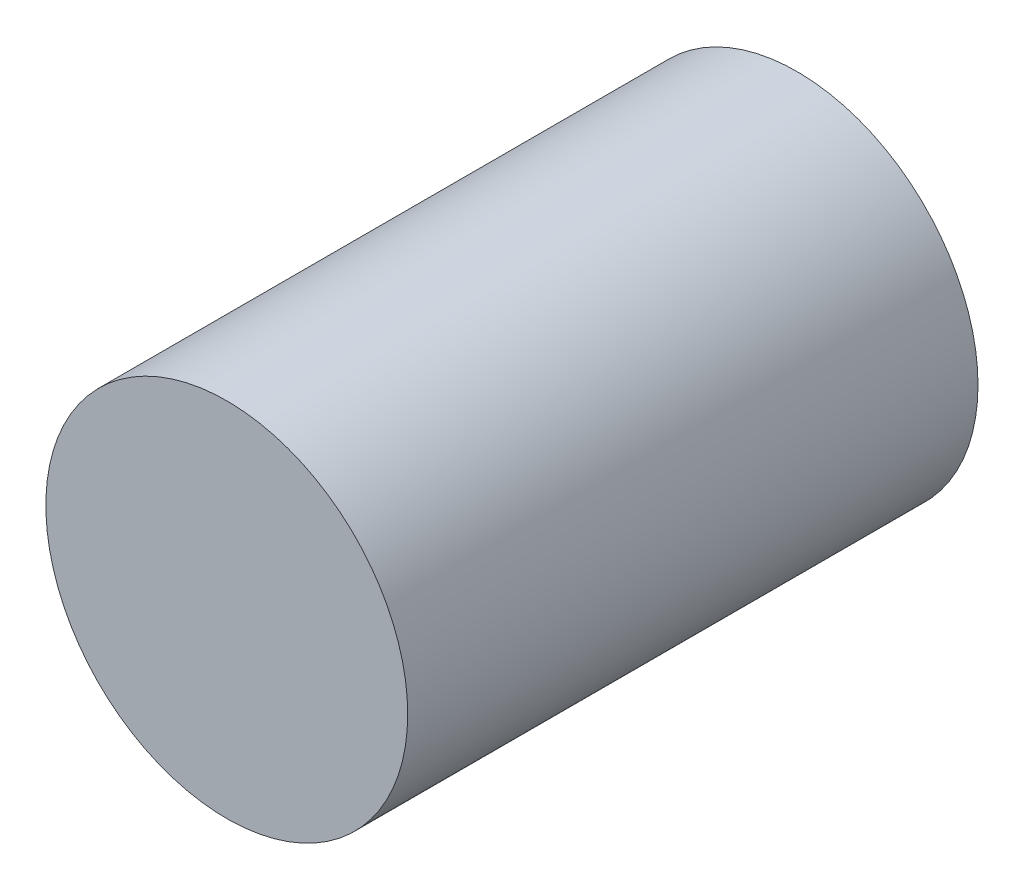
ISO-10303-21;
HEADER;
FILE_DESCRIPTION(('STEP AP214'),'2;1');
FILE_NAME('part.step','',(''),(''),'','','');
FILE_SCHEMA(('AUTOMOTIVE_DESIGN { 1 0 10303 214 1 1 1 1 }'));
ENDSEC;
DATA;
#1=APPLICATION_CONTEXT('core data for automotive mechanical design processes');
#2=APPLICATION_PROTOCOL_DEFINITION('international standard','automotive_design',2000,#1);
#3=PRODUCT_CONTEXT('',#1,'mechanical');
#4=PRODUCT('Part','Part','',(#3));
#5=PRODUCT_RELATED_PRODUCT_CATEGORY('part','',(#4));
#6=PRODUCT_DEFINITION_FORMATION('','',#4);
#7=PRODUCT_DEFINITION_CONTEXT('part definition',#1,'design');
#8=PRODUCT_DEFINITION('design','',#6,#7);
#9=PRODUCT_DEFINITION_SHAPE('','',#8);
#10=(LENGTH_UNIT() NAMED_UNIT(*) SI_UNIT(.MILLI.,.METRE.));
#11=(NAMED_UNIT(*) PLANE_ANGLE_UNIT() SI_UNIT($,.RADIAN.));
#12=(NAMED_UNIT(*) SI_UNIT($,.STERADIAN.) SOLID_ANGLE_UNIT());
#13=UNCERTAINTY_MEASURE_WITH_UNIT(LENGTH_MEASURE(1.E-05),#10,'distance_accuracy_value','');
#14=(GEOMETRIC_REPRESENTATION_CONTEXT(3) GLOBAL_UNCERTAINTY_ASSIGNED_CONTEXT((#13)) GLOBAL_UNIT_ASSIGNED_CONTEXT((#10,
#11,#12)) REPRESENTATION_CONTEXT('',''));
#15=CARTESIAN_POINT('',(0.,0.,0.));
#16=DIRECTION('',(0.,0.,1.));
#17=DIRECTION('',(1.,0.,0.));
#18=AXIS2_PLACEMENT_3D('',#15,#16,#17);
#19=CARTESIAN_POINT('',(0.,62.,-47.2445742854948));
#20=DIRECTION('',(0.,0.,1.));
#21=DIRECTION('',(1.,0.,0.));
#22=AXIS2_PLACEMENT_3D('',#19,#20,#21);
#23=CYLINDRICAL_SURFACE('',#22,7.90000000000001);
#24=CARTESIAN_POINT('',(0.,62.,-24.8999999999999));
#25=DIRECTION('',(0.,0.,1.));
#26=DIRECTION('',(1.,0.,0.));
#27=AXIS2_PLACEMENT_3D('',#24,#25,#26);
#28=CIRCLE('',#27,7.90000000000001);
#29=CARTESIAN_POINT('',(7.90000000000001,62.,-24.8999999999999));
#30=VERTEX_POINT('',#29);
#31=EDGE_CURVE('E10',#30,#30,#28,.F.);
#32=ORIENTED_EDGE('',*,*,#31,.F.);
#33=EDGE_LOOP('',(#32));
#34=FACE_BOUND('',#33,.T.);
#35=CARTESIAN_POINT('',(0.,62.,0.));
#36=DIRECTION('',(0.,0.,1.));
#37=DIRECTION('',(1.,0.,0.));
#38=AXIS2_PLACEMENT_3D('',#35,#36,#37);
#39=CIRCLE('',#38,7.90000000000001);
#40=CARTESIAN_POINT('',(7.90000000000001,62.,0.));
#41=VERTEX_POINT('',#40);
#42=EDGE_CURVE('E39',#41,#41,#39,.T.);
#43=ORIENTED_EDGE('',*,*,#42,.F.);
#44=EDGE_LOOP('',(#43));
#45=FACE_BOUND('',#44,.T.);
#46=ADVANCED_FACE('F33',(#34,#45),#23,.T.);
#47=CARTESIAN_POINT('',(0.,62.,0.));
#48=DIRECTION('',(0.,0.,1.));
#49=DIRECTION('',(1.,0.,0.));
#50=AXIS2_PLACEMENT_3D('',#47,#48,#49);
#51=PLANE('',#50);
#52=ORIENTED_EDGE('',*,*,#42,.T.);
#53=EDGE_LOOP('',(#52));
#54=FACE_BOUND('',#53,.T.);
#55=ADVANCED_FACE('F45',(#54),#51,.T.);
#56=CARTESIAN_POINT('',(-2.9773827413372,69.3174580293697,-24.8999999999999));
#57=DIRECTION('',(0.,0.,1.));
#58=DIRECTION('',(0.926260510046745,0.376883891308642,0.));
#59=AXIS2_PLACEMENT_3D('',#56,#57,#58);
#60=PLANE('',#59);
#61=ORIENTED_EDGE('',*,*,#31,.T.);
#62=EDGE_LOOP('',(#61));
#63=FACE_BOUND('',#62,.T.);
#64=ADVANCED_FACE('F52',(#63),#60,.F.);
#65=CLOSED_SHELL('',(#46,#55,#64));
#66=MANIFOLD_SOLID_BREP('B2',#65);
#67=ADVANCED_BREP_SHAPE_REPRESENTATION('',(#18,#66),#14);
#68=SHAPE_DEFINITION_REPRESENTATION(#9,#67);
ENDSEC;
END-ISO-10303-21;
